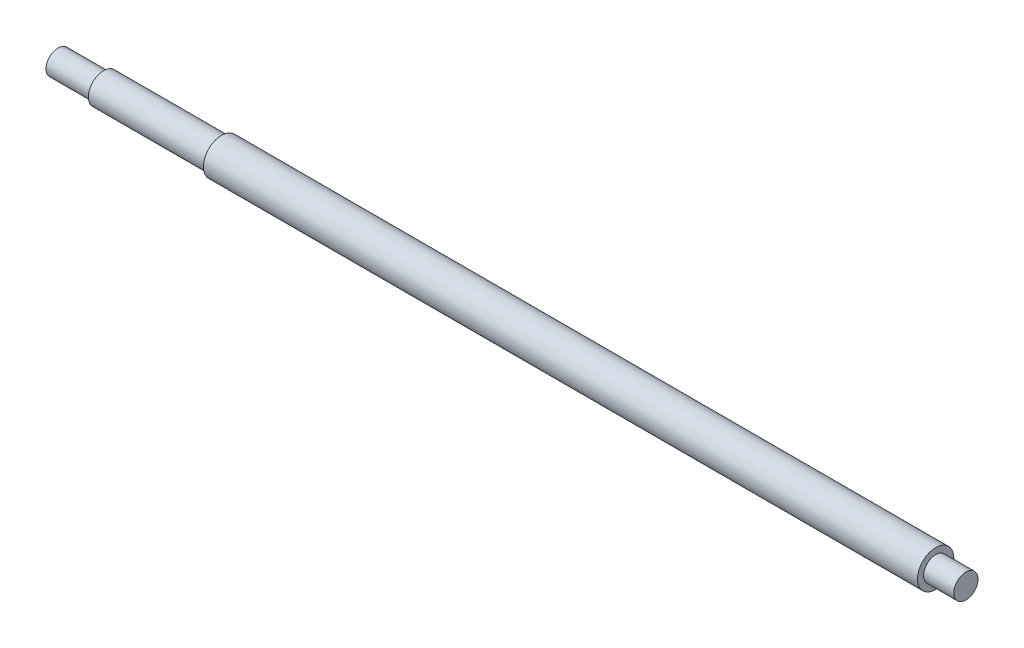
ISO-10303-21;
HEADER;
FILE_DESCRIPTION(('STEP AP214'),'2;1');
FILE_NAME('part.step','',(''),(''),'','','');
FILE_SCHEMA(('AUTOMOTIVE_DESIGN { 1 0 10303 214 1 1 1 1 }'));
ENDSEC;
DATA;
#1=APPLICATION_CONTEXT('core data for automotive mechanical design processes');
#2=APPLICATION_PROTOCOL_DEFINITION('international standard','automotive_design',2000,#1);
#3=PRODUCT_CONTEXT('',#1,'mechanical');
#4=PRODUCT('Part','Part','',(#3));
#5=PRODUCT_RELATED_PRODUCT_CATEGORY('part','',(#4));
#6=PRODUCT_DEFINITION_FORMATION('','',#4);
#7=PRODUCT_DEFINITION_CONTEXT('part definition',#1,'design');
#8=PRODUCT_DEFINITION('design','',#6,#7);
#9=PRODUCT_DEFINITION_SHAPE('','',#8);
#10=(LENGTH_UNIT() NAMED_UNIT(*) SI_UNIT(.MILLI.,.METRE.));
#11=(NAMED_UNIT(*) PLANE_ANGLE_UNIT() SI_UNIT($,.RADIAN.));
#12=(NAMED_UNIT(*) SI_UNIT($,.STERADIAN.) SOLID_ANGLE_UNIT());
#13=UNCERTAINTY_MEASURE_WITH_UNIT(LENGTH_MEASURE(1.E-05),#10,'distance_accuracy_value','');
#14=(GEOMETRIC_REPRESENTATION_CONTEXT(3) GLOBAL_UNCERTAINTY_ASSIGNED_CONTEXT((#13)) GLOBAL_UNIT_ASSIGNED_CONTEXT((#10,
#11,#12)) REPRESENTATION_CONTEXT('',''));
#15=CARTESIAN_POINT('',(0.,0.,0.));
#16=DIRECTION('',(0.,0.,1.));
#17=DIRECTION('',(1.,0.,0.));
#18=AXIS2_PLACEMENT_3D('',#15,#16,#17);
#19=CARTESIAN_POINT('',(0.,0.,0.));
#20=DIRECTION('',(1.,0.,0.));
#21=DIRECTION('',(0.,0.,-1.));
#22=AXIS2_PLACEMENT_3D('',#19,#20,#21);
#23=PLANE('',#22);
#24=CARTESIAN_POINT('',(0.,0.,0.));
#25=DIRECTION('',(-1.,0.,0.));
#26=DIRECTION('',(0.,0.,1.));
#27=AXIS2_PLACEMENT_3D('',#24,#25,#26);
#28=CIRCLE('',#27,4.);
#29=CARTESIAN_POINT('',(0.,0.,4.));
#30=VERTEX_POINT('',#29);
#31=EDGE_CURVE('E10',#30,#30,#28,.T.);
#32=ORIENTED_EDGE('',*,*,#31,.T.);
#33=EDGE_LOOP('',(#32));
#34=FACE_BOUND('',#33,.T.);
#35=ADVANCED_FACE('F34',(#34),#23,.F.);
#36=CARTESIAN_POINT('',(0.,0.,0.));
#37=DIRECTION('',(-1.,0.,0.));
#38=DIRECTION('',(0.,0.,1.));
#39=AXIS2_PLACEMENT_3D('',#36,#37,#38);
#40=CYLINDRICAL_SURFACE('',#39,4.);
#41=ORIENTED_EDGE('',*,*,#31,.F.);
#42=EDGE_LOOP('',(#41));
#43=FACE_BOUND('',#42,.T.);
#44=CARTESIAN_POINT('',(15.,0.,0.));
#45=DIRECTION('',(-1.,0.,0.));
#46=DIRECTION('',(0.,0.,1.));
#47=AXIS2_PLACEMENT_3D('',#44,#45,#46);
#48=CIRCLE('',#47,4.);
#49=CARTESIAN_POINT('',(15.,0.,4.));
#50=VERTEX_POINT('',#49);
#51=EDGE_CURVE('E40',#50,#50,#48,.T.);
#52=ORIENTED_EDGE('',*,*,#51,.T.);
#53=EDGE_LOOP('',(#52));
#54=FACE_BOUND('',#53,.T.);
#55=ADVANCED_FACE('F78',(#43,#54),#40,.T.);
#56=CARTESIAN_POINT('',(15.,4.,0.));
#57=DIRECTION('',(1.,0.,0.));
#58=DIRECTION('',(0.,0.,-1.));
#59=AXIS2_PLACEMENT_3D('',#56,#57,#58);
#60=PLANE('',#59);
#61=ORIENTED_EDGE('',*,*,#51,.F.);
#62=EDGE_LOOP('',(#61));
#63=FACE_BOUND('',#62,.T.);
#64=CARTESIAN_POINT('',(15.,0.,0.));
#65=DIRECTION('',(-1.,0.,0.));
#66=DIRECTION('',(0.,0.,1.));
#67=AXIS2_PLACEMENT_3D('',#64,#65,#66);
#68=CIRCLE('',#67,5.);
#69=CARTESIAN_POINT('',(15.,0.,5.));
#70=VERTEX_POINT('',#69);
#71=EDGE_CURVE('E44',#70,#70,#68,.T.);
#72=ORIENTED_EDGE('',*,*,#71,.T.);
#73=EDGE_LOOP('',(#72));
#74=FACE_BOUND('',#73,.T.);
#75=ADVANCED_FACE('F82',(#63,#74),#60,.F.);
#76=CARTESIAN_POINT('',(0.,0.,0.));
#77=DIRECTION('',(-1.,0.,0.));
#78=DIRECTION('',(0.,0.,1.));
#79=AXIS2_PLACEMENT_3D('',#76,#77,#78);
#80=CYLINDRICAL_SURFACE('',#79,5.);
#81=ORIENTED_EDGE('',*,*,#71,.F.);
#82=EDGE_LOOP('',(#81));
#83=FACE_BOUND('',#82,.T.);
#84=CARTESIAN_POINT('',(54.,0.,0.));
#85=DIRECTION('',(-1.,0.,0.));
#86=DIRECTION('',(0.,0.,1.));
#87=AXIS2_PLACEMENT_3D('',#84,#85,#86);
#88=CIRCLE('',#87,5.);
#89=CARTESIAN_POINT('',(54.,0.,5.));
#90=VERTEX_POINT('',#89);
#91=EDGE_CURVE('E48',#90,#90,#88,.T.);
#92=ORIENTED_EDGE('',*,*,#91,.T.);
#93=EDGE_LOOP('',(#92));
#94=FACE_BOUND('',#93,.T.);
#95=ADVANCED_FACE('F87',(#83,#94),#80,.T.);
#96=CARTESIAN_POINT('',(54.,5.,0.));
#97=DIRECTION('',(1.,0.,0.));
#98=DIRECTION('',(0.,0.,-1.));
#99=AXIS2_PLACEMENT_3D('',#96,#97,#98);
#100=PLANE('',#99);
#101=ORIENTED_EDGE('',*,*,#91,.F.);
#102=EDGE_LOOP('',(#101));
#103=FACE_BOUND('',#102,.T.);
#104=CARTESIAN_POINT('',(54.,0.,0.));
#105=DIRECTION('',(-1.,0.,0.));
#106=DIRECTION('',(0.,0.,1.));
#107=AXIS2_PLACEMENT_3D('',#104,#105,#106);
#108=CIRCLE('',#107,6.);
#109=CARTESIAN_POINT('',(54.,0.,6.));
#110=VERTEX_POINT('',#109);
#111=EDGE_CURVE('E53',#110,#110,#108,.T.);
#112=ORIENTED_EDGE('',*,*,#111,.T.);
#113=EDGE_LOOP('',(#112));
#114=FACE_BOUND('',#113,.T.);
#115=ADVANCED_FACE('F93',(#103,#114),#100,.F.);
#116=CARTESIAN_POINT('',(0.,0.,0.));
#117=DIRECTION('',(-1.,0.,0.));
#118=DIRECTION('',(0.,0.,1.));
#119=AXIS2_PLACEMENT_3D('',#116,#117,#118);
#120=CYLINDRICAL_SURFACE('',#119,6.);
#121=ORIENTED_EDGE('',*,*,#111,.F.);
#122=EDGE_LOOP('',(#121));
#123=FACE_BOUND('',#122,.T.);
#124=CARTESIAN_POINT('',(290.,0.,0.));
#125=DIRECTION('',(-1.,0.,0.));
#126=DIRECTION('',(0.,0.,1.));
#127=AXIS2_PLACEMENT_3D('',#124,#125,#126);
#128=CIRCLE('',#127,6.);
#129=CARTESIAN_POINT('',(290.,0.,6.));
#130=VERTEX_POINT('',#129);
#131=EDGE_CURVE('E56',#130,#130,#128,.T.);
#132=ORIENTED_EDGE('',*,*,#131,.T.);
#133=EDGE_LOOP('',(#132));
#134=FACE_BOUND('',#133,.T.);
#135=ADVANCED_FACE('F97',(#123,#134),#120,.T.);
#136=CARTESIAN_POINT('',(290.,6.,0.));
#137=DIRECTION('',(-1.,0.,0.));
#138=DIRECTION('',(0.,0.,1.));
#139=AXIS2_PLACEMENT_3D('',#136,#137,#138);
#140=PLANE('',#139);
#141=ORIENTED_EDGE('',*,*,#131,.F.);
#142=EDGE_LOOP('',(#141));
#143=FACE_BOUND('',#142,.T.);
#144=CARTESIAN_POINT('',(290.,0.,0.));
#145=DIRECTION('',(-1.,0.,0.));
#146=DIRECTION('',(0.,0.,1.));
#147=AXIS2_PLACEMENT_3D('',#144,#145,#146);
#148=CIRCLE('',#147,4.);
#149=CARTESIAN_POINT('',(290.,0.,4.));
#150=VERTEX_POINT('',#149);
#151=EDGE_CURVE('E59',#150,#150,#148,.T.);
#152=ORIENTED_EDGE('',*,*,#151,.T.);
#153=EDGE_LOOP('',(#152));
#154=FACE_BOUND('',#153,.T.);
#155=ADVANCED_FACE('F74',(#143,#154),#140,.F.);
#156=CARTESIAN_POINT('',(0.,0.,0.));
#157=DIRECTION('',(-1.,0.,0.));
#158=DIRECTION('',(0.,0.,1.));
#159=AXIS2_PLACEMENT_3D('',#156,#157,#158);
#160=CYLINDRICAL_SURFACE('',#159,4.);
#161=ORIENTED_EDGE('',*,*,#151,.F.);
#162=EDGE_LOOP('',(#161));
#163=FACE_BOUND('',#162,.T.);
#164=CARTESIAN_POINT('',(300.,0.,0.));
#165=DIRECTION('',(-1.,0.,0.));
#166=DIRECTION('',(0.,0.,1.));
#167=AXIS2_PLACEMENT_3D('',#164,#165,#166);
#168=CIRCLE('',#167,4.);
#169=CARTESIAN_POINT('',(300.,0.,4.));
#170=VERTEX_POINT('',#169);
#171=EDGE_CURVE('E62',#170,#170,#168,.T.);
#172=ORIENTED_EDGE('',*,*,#171,.T.);
#173=EDGE_LOOP('',(#172));
#174=FACE_BOUND('',#173,.T.);
#175=ADVANCED_FACE('F66',(#163,#174),#160,.T.);
#176=CARTESIAN_POINT('',(300.,4.,0.));
#177=DIRECTION('',(-1.,0.,0.));
#178=DIRECTION('',(0.,0.,1.));
#179=AXIS2_PLACEMENT_3D('',#176,#177,#178);
#180=PLANE('',#179);
#181=ORIENTED_EDGE('',*,*,#171,.F.);
#182=EDGE_LOOP('',(#181));
#183=FACE_BOUND('',#182,.T.);
#184=ADVANCED_FACE('F68',(#183),#180,.F.);
#185=CLOSED_SHELL('',(#35,#55,#75,#95,#115,#135,#155,#175,#184));
#186=MANIFOLD_SOLID_BREP('B2',#185);
#187=ADVANCED_BREP_SHAPE_REPRESENTATION('',(#18,#186),#14);
#188=SHAPE_DEFINITION_REPRESENTATION(#9,#187);
ENDSEC;
END-ISO-10303-21;
